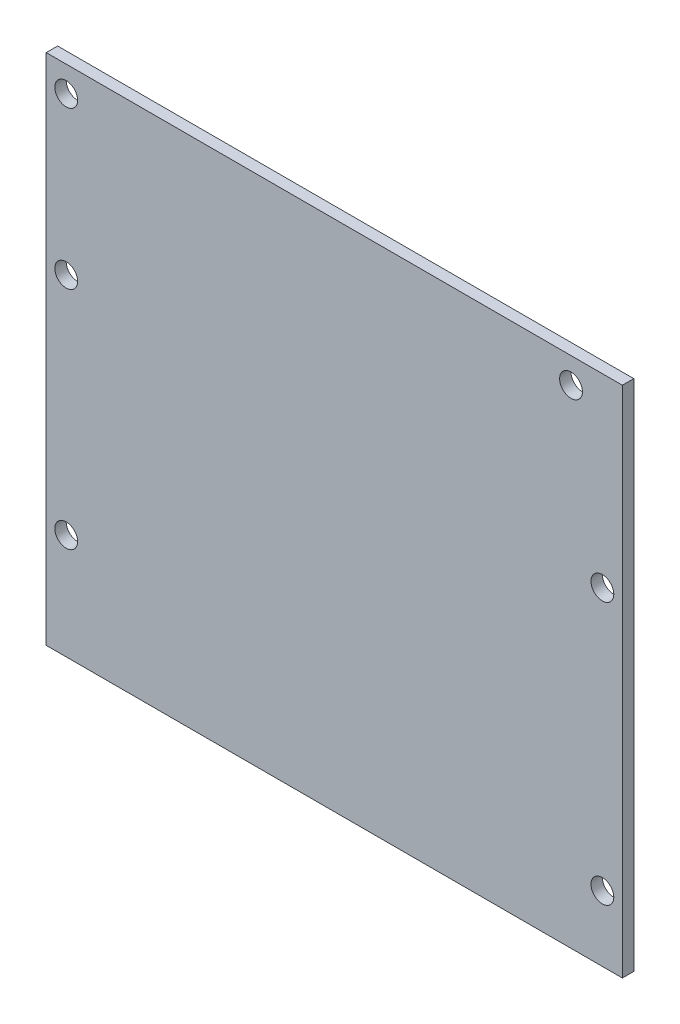
ISO-10303-21;
HEADER;
FILE_DESCRIPTION(('STEP AP214'),'2;1');
FILE_NAME('part.step','',(''),(''),'','','');
FILE_SCHEMA(('AUTOMOTIVE_DESIGN { 1 0 10303 214 1 1 1 1 }'));
ENDSEC;
DATA;
#1=APPLICATION_CONTEXT('core data for automotive mechanical design processes');
#2=APPLICATION_PROTOCOL_DEFINITION('international standard','automotive_design',2000,#1);
#3=PRODUCT_CONTEXT('',#1,'mechanical');
#4=PRODUCT('Part','Part','',(#3));
#5=PRODUCT_RELATED_PRODUCT_CATEGORY('part','',(#4));
#6=PRODUCT_DEFINITION_FORMATION('','',#4);
#7=PRODUCT_DEFINITION_CONTEXT('part definition',#1,'design');
#8=PRODUCT_DEFINITION('design','',#6,#7);
#9=PRODUCT_DEFINITION_SHAPE('','',#8);
#10=(LENGTH_UNIT() NAMED_UNIT(*) SI_UNIT(.MILLI.,.METRE.));
#11=(NAMED_UNIT(*) PLANE_ANGLE_UNIT() SI_UNIT($,.RADIAN.));
#12=(NAMED_UNIT(*) SI_UNIT($,.STERADIAN.) SOLID_ANGLE_UNIT());
#13=UNCERTAINTY_MEASURE_WITH_UNIT(LENGTH_MEASURE(1.E-05),#10,'distance_accuracy_value','');
#14=(GEOMETRIC_REPRESENTATION_CONTEXT(3) GLOBAL_UNCERTAINTY_ASSIGNED_CONTEXT((#13)) GLOBAL_UNIT_ASSIGNED_CONTEXT((#10,
#11,#12)) REPRESENTATION_CONTEXT('',''));
#15=CARTESIAN_POINT('',(0.,0.,0.));
#16=DIRECTION('',(0.,0.,1.));
#17=DIRECTION('',(1.,0.,0.));
#18=AXIS2_PLACEMENT_3D('',#15,#16,#17);
#19=CARTESIAN_POINT('',(0.,0.,2.));
#20=DIRECTION('',(1.,0.,0.));
#21=DIRECTION('',(0.,0.,-1.));
#22=AXIS2_PLACEMENT_3D('',#19,#20,#21);
#23=PLANE('',#22);
#24=DIRECTION('',(0.,-1.,0.));
#25=VECTOR('',#24,1.);
#26=CARTESIAN_POINT('',(0.,0.,0.));
#27=LINE('',#26,#25);
#28=CARTESIAN_POINT('',(0.,90.,0.));
#29=VERTEX_POINT('',#28);
#30=CARTESIAN_POINT('',(0.,0.,0.));
#31=VERTEX_POINT('',#30);
#32=EDGE_CURVE('E95',#29,#31,#27,.T.);
#33=ORIENTED_EDGE('',*,*,#32,.T.);
#34=DIRECTION('',(0.,0.,-1.));
#35=VECTOR('',#34,1.);
#36=CARTESIAN_POINT('',(0.,0.,2.));
#37=LINE('',#36,#35);
#38=CARTESIAN_POINT('',(0.,0.,2.));
#39=VERTEX_POINT('',#38);
#40=EDGE_CURVE('E11',#39,#31,#37,.T.);
#41=ORIENTED_EDGE('',*,*,#40,.F.);
#42=DIRECTION('',(0.,-1.,0.));
#43=VECTOR('',#42,1.);
#44=CARTESIAN_POINT('',(0.,0.,2.));
#45=LINE('',#44,#43);
#46=CARTESIAN_POINT('',(0.,90.,2.));
#47=VERTEX_POINT('',#46);
#48=EDGE_CURVE('E83',#47,#39,#45,.T.);
#49=ORIENTED_EDGE('',*,*,#48,.F.);
#50=DIRECTION('',(0.,0.,-1.));
#51=VECTOR('',#50,1.);
#52=CARTESIAN_POINT('',(0.,90.,2.));
#53=LINE('',#52,#51);
#54=EDGE_CURVE('E91',#47,#29,#53,.T.);
#55=ORIENTED_EDGE('',*,*,#54,.T.);
#56=EDGE_LOOP('',(#33,#41,#49,#55));
#57=FACE_BOUND('',#56,.T.);
#58=ADVANCED_FACE('F32',(#57),#23,.F.);
#59=CARTESIAN_POINT('',(0.,0.,2.));
#60=DIRECTION('',(0.,1.,0.));
#61=DIRECTION('',(0.,0.,1.));
#62=AXIS2_PLACEMENT_3D('',#59,#60,#61);
#63=PLANE('',#62);
#64=DIRECTION('',(1.,0.,0.));
#65=VECTOR('',#64,1.);
#66=CARTESIAN_POINT('',(0.,0.,0.));
#67=LINE('',#66,#65);
#68=CARTESIAN_POINT('',(101.,0.,0.));
#69=VERTEX_POINT('',#68);
#70=EDGE_CURVE('E87',#31,#69,#67,.T.);
#71=ORIENTED_EDGE('',*,*,#70,.T.);
#72=DIRECTION('',(0.,0.,-1.));
#73=VECTOR('',#72,1.);
#74=CARTESIAN_POINT('',(101.,0.,2.));
#75=LINE('',#74,#73);
#76=CARTESIAN_POINT('',(101.,0.,2.));
#77=VERTEX_POINT('',#76);
#78=EDGE_CURVE('E40',#77,#69,#75,.T.);
#79=ORIENTED_EDGE('',*,*,#78,.F.);
#80=DIRECTION('',(1.,0.,0.));
#81=VECTOR('',#80,1.);
#82=CARTESIAN_POINT('',(0.,0.,2.));
#83=LINE('',#82,#81);
#84=EDGE_CURVE('E78',#39,#77,#83,.T.);
#85=ORIENTED_EDGE('',*,*,#84,.F.);
#86=ORIENTED_EDGE('',*,*,#40,.T.);
#87=EDGE_LOOP('',(#71,#79,#85,#86));
#88=FACE_BOUND('',#87,.T.);
#89=ADVANCED_FACE('F86',(#88),#63,.F.);
#90=CARTESIAN_POINT('',(101.,0.,2.));
#91=DIRECTION('',(-1.,0.,0.));
#92=DIRECTION('',(0.,0.,1.));
#93=AXIS2_PLACEMENT_3D('',#90,#91,#92);
#94=PLANE('',#93);
#95=DIRECTION('',(0.,1.,0.));
#96=VECTOR('',#95,1.);
#97=CARTESIAN_POINT('',(101.,0.,0.));
#98=LINE('',#97,#96);
#99=CARTESIAN_POINT('',(101.,90.,0.));
#100=VERTEX_POINT('',#99);
#101=EDGE_CURVE('E65',#69,#100,#98,.T.);
#102=ORIENTED_EDGE('',*,*,#101,.T.);
#103=DIRECTION('',(0.,0.,-1.));
#104=VECTOR('',#103,1.);
#105=CARTESIAN_POINT('',(101.,90.,2.));
#106=LINE('',#105,#104);
#107=CARTESIAN_POINT('',(101.,90.,2.));
#108=VERTEX_POINT('',#107);
#109=EDGE_CURVE('E88',#108,#100,#106,.T.);
#110=ORIENTED_EDGE('',*,*,#109,.F.);
#111=DIRECTION('',(0.,1.,0.));
#112=VECTOR('',#111,1.);
#113=CARTESIAN_POINT('',(101.,0.,2.));
#114=LINE('',#113,#112);
#115=EDGE_CURVE('E81',#77,#108,#114,.T.);
#116=ORIENTED_EDGE('',*,*,#115,.F.);
#117=ORIENTED_EDGE('',*,*,#78,.T.);
#118=EDGE_LOOP('',(#102,#110,#116,#117));
#119=FACE_BOUND('',#118,.T.);
#120=ADVANCED_FACE('F89',(#119),#94,.F.);
#121=CARTESIAN_POINT('',(0.,90.,2.));
#122=DIRECTION('',(0.,-1.,0.));
#123=DIRECTION('',(0.,0.,-1.));
#124=AXIS2_PLACEMENT_3D('',#121,#122,#123);
#125=PLANE('',#124);
#126=DIRECTION('',(-1.,0.,0.));
#127=VECTOR('',#126,1.);
#128=CARTESIAN_POINT('',(0.,90.,0.));
#129=LINE('',#128,#127);
#130=EDGE_CURVE('E71',#100,#29,#129,.T.);
#131=ORIENTED_EDGE('',*,*,#130,.T.);
#132=ORIENTED_EDGE('',*,*,#54,.F.);
#133=DIRECTION('',(-1.,0.,0.));
#134=VECTOR('',#133,1.);
#135=CARTESIAN_POINT('',(0.,90.,2.));
#136=LINE('',#135,#134);
#137=EDGE_CURVE('E48',#108,#47,#136,.T.);
#138=ORIENTED_EDGE('',*,*,#137,.F.);
#139=ORIENTED_EDGE('',*,*,#109,.T.);
#140=EDGE_LOOP('',(#131,#132,#138,#139));
#141=FACE_BOUND('',#140,.T.);
#142=ADVANCED_FACE('F103',(#141),#125,.F.);
#143=CARTESIAN_POINT('',(0.,0.,2.));
#144=DIRECTION('',(0.,0.,-1.));
#145=DIRECTION('',(-1.,0.,0.));
#146=AXIS2_PLACEMENT_3D('',#143,#144,#145);
#147=PLANE('',#146);
#148=CARTESIAN_POINT('',(92.,85.5,2.));
#149=DIRECTION('',(0.,0.,1.));
#150=DIRECTION('',(1.,0.,0.));
#151=AXIS2_PLACEMENT_3D('',#148,#149,#150);
#152=CIRCLE('',#151,2.);
#153=CARTESIAN_POINT('',(94.,85.5,2.));
#154=VERTEX_POINT('',#153);
#155=EDGE_CURVE('E127',#154,#154,#152,.T.);
#156=ORIENTED_EDGE('',*,*,#155,.F.);
#157=EDGE_LOOP('',(#156));
#158=FACE_BOUND('',#157,.T.);
#159=CARTESIAN_POINT('',(3.5,85.5,2.));
#160=DIRECTION('',(0.,0.,1.));
#161=DIRECTION('',(1.,0.,0.));
#162=AXIS2_PLACEMENT_3D('',#159,#160,#161);
#163=CIRCLE('',#162,2.);
#164=CARTESIAN_POINT('',(5.5,85.5,2.));
#165=VERTEX_POINT('',#164);
#166=EDGE_CURVE('E133',#165,#165,#163,.T.);
#167=ORIENTED_EDGE('',*,*,#166,.F.);
#168=EDGE_LOOP('',(#167));
#169=FACE_BOUND('',#168,.T.);
#170=CARTESIAN_POINT('',(3.5,18.5,2.));
#171=DIRECTION('',(0.,0.,1.));
#172=DIRECTION('',(1.,0.,0.));
#173=AXIS2_PLACEMENT_3D('',#170,#171,#172);
#174=CIRCLE('',#173,2.);
#175=CARTESIAN_POINT('',(5.5,18.5,2.));
#176=VERTEX_POINT('',#175);
#177=EDGE_CURVE('E139',#176,#176,#174,.T.);
#178=ORIENTED_EDGE('',*,*,#177,.F.);
#179=EDGE_LOOP('',(#178));
#180=FACE_BOUND('',#179,.T.);
#181=CARTESIAN_POINT('',(3.5,58.,2.));
#182=DIRECTION('',(0.,0.,1.));
#183=DIRECTION('',(1.,0.,0.));
#184=AXIS2_PLACEMENT_3D('',#181,#182,#183);
#185=CIRCLE('',#184,2.);
#186=CARTESIAN_POINT('',(5.5,58.,2.));
#187=VERTEX_POINT('',#186);
#188=EDGE_CURVE('E115',#187,#187,#185,.T.);
#189=ORIENTED_EDGE('',*,*,#188,.F.);
#190=EDGE_LOOP('',(#189));
#191=FACE_BOUND('',#190,.T.);
#192=CARTESIAN_POINT('',(97.5,57.5,2.));
#193=DIRECTION('',(0.,0.,1.));
#194=DIRECTION('',(1.,0.,0.));
#195=AXIS2_PLACEMENT_3D('',#192,#193,#194);
#196=CIRCLE('',#195,2.);
#197=CARTESIAN_POINT('',(99.5,57.5,2.));
#198=VERTEX_POINT('',#197);
#199=EDGE_CURVE('E122',#198,#198,#196,.T.);
#200=ORIENTED_EDGE('',*,*,#199,.F.);
#201=EDGE_LOOP('',(#200));
#202=FACE_BOUND('',#201,.T.);
#203=CARTESIAN_POINT('',(97.5,11.5,2.));
#204=DIRECTION('',(0.,0.,1.));
#205=DIRECTION('',(1.,0.,0.));
#206=AXIS2_PLACEMENT_3D('',#203,#204,#205);
#207=CIRCLE('',#206,2.);
#208=CARTESIAN_POINT('',(99.5,11.5,2.));
#209=VERTEX_POINT('',#208);
#210=EDGE_CURVE('E109',#209,#209,#207,.T.);
#211=ORIENTED_EDGE('',*,*,#210,.F.);
#212=EDGE_LOOP('',(#211));
#213=FACE_BOUND('',#212,.T.);
#214=ORIENTED_EDGE('',*,*,#48,.T.);
#215=ORIENTED_EDGE('',*,*,#84,.T.);
#216=ORIENTED_EDGE('',*,*,#115,.T.);
#217=ORIENTED_EDGE('',*,*,#137,.T.);
#218=EDGE_LOOP('',(#214,#215,#216,#217));
#219=FACE_BOUND('',#218,.T.);
#220=ADVANCED_FACE('F79',(#158,#169,#180,#191,#202,#213,#219),#147,.F.);
#221=CARTESIAN_POINT('',(0.,0.,0.));
#222=DIRECTION('',(0.,0.,-1.));
#223=DIRECTION('',(-1.,0.,0.));
#224=AXIS2_PLACEMENT_3D('',#221,#222,#223);
#225=PLANE('',#224);
#226=CARTESIAN_POINT('',(92.,85.5,0.));
#227=DIRECTION('',(0.,0.,1.));
#228=DIRECTION('',(1.,0.,0.));
#229=AXIS2_PLACEMENT_3D('',#226,#227,#228);
#230=CIRCLE('',#229,2.);
#231=CARTESIAN_POINT('',(94.,85.5,0.));
#232=VERTEX_POINT('',#231);
#233=EDGE_CURVE('E130',#232,#232,#230,.T.);
#234=ORIENTED_EDGE('',*,*,#233,.T.);
#235=EDGE_LOOP('',(#234));
#236=FACE_BOUND('',#235,.T.);
#237=CARTESIAN_POINT('',(3.5,85.5,0.));
#238=DIRECTION('',(0.,0.,1.));
#239=DIRECTION('',(1.,0.,0.));
#240=AXIS2_PLACEMENT_3D('',#237,#238,#239);
#241=CIRCLE('',#240,2.);
#242=CARTESIAN_POINT('',(5.5,85.5,0.));
#243=VERTEX_POINT('',#242);
#244=EDGE_CURVE('E136',#243,#243,#241,.T.);
#245=ORIENTED_EDGE('',*,*,#244,.T.);
#246=EDGE_LOOP('',(#245));
#247=FACE_BOUND('',#246,.T.);
#248=CARTESIAN_POINT('',(3.5,18.5,0.));
#249=DIRECTION('',(0.,0.,1.));
#250=DIRECTION('',(1.,0.,0.));
#251=AXIS2_PLACEMENT_3D('',#248,#249,#250);
#252=CIRCLE('',#251,2.);
#253=CARTESIAN_POINT('',(5.5,18.5,0.));
#254=VERTEX_POINT('',#253);
#255=EDGE_CURVE('E119',#254,#254,#252,.T.);
#256=ORIENTED_EDGE('',*,*,#255,.T.);
#257=EDGE_LOOP('',(#256));
#258=FACE_BOUND('',#257,.T.);
#259=CARTESIAN_POINT('',(3.5,58.,0.));
#260=DIRECTION('',(0.,0.,1.));
#261=DIRECTION('',(1.,0.,0.));
#262=AXIS2_PLACEMENT_3D('',#259,#260,#261);
#263=CIRCLE('',#262,2.);
#264=CARTESIAN_POINT('',(5.5,58.,0.));
#265=VERTEX_POINT('',#264);
#266=EDGE_CURVE('E118',#265,#265,#263,.T.);
#267=ORIENTED_EDGE('',*,*,#266,.T.);
#268=EDGE_LOOP('',(#267));
#269=FACE_BOUND('',#268,.T.);
#270=CARTESIAN_POINT('',(97.5,57.5,0.));
#271=DIRECTION('',(0.,0.,1.));
#272=DIRECTION('',(1.,0.,0.));
#273=AXIS2_PLACEMENT_3D('',#270,#271,#272);
#274=CIRCLE('',#273,2.);
#275=CARTESIAN_POINT('',(99.5,57.5,0.));
#276=VERTEX_POINT('',#275);
#277=EDGE_CURVE('E112',#276,#276,#274,.T.);
#278=ORIENTED_EDGE('',*,*,#277,.T.);
#279=EDGE_LOOP('',(#278));
#280=FACE_BOUND('',#279,.T.);
#281=CARTESIAN_POINT('',(97.5,11.5,0.));
#282=DIRECTION('',(0.,0.,1.));
#283=DIRECTION('',(1.,0.,0.));
#284=AXIS2_PLACEMENT_3D('',#281,#282,#283);
#285=CIRCLE('',#284,2.);
#286=CARTESIAN_POINT('',(99.5,11.5,0.));
#287=VERTEX_POINT('',#286);
#288=EDGE_CURVE('E98',#287,#287,#285,.T.);
#289=ORIENTED_EDGE('',*,*,#288,.T.);
#290=EDGE_LOOP('',(#289));
#291=FACE_BOUND('',#290,.T.);
#292=ORIENTED_EDGE('',*,*,#32,.F.);
#293=ORIENTED_EDGE('',*,*,#130,.F.);
#294=ORIENTED_EDGE('',*,*,#101,.F.);
#295=ORIENTED_EDGE('',*,*,#70,.F.);
#296=EDGE_LOOP('',(#292,#293,#294,#295));
#297=FACE_BOUND('',#296,.T.);
#298=ADVANCED_FACE('F106',(#236,#247,#258,#269,#280,#291,#297),#225,.T.);
#299=CARTESIAN_POINT('',(97.5,11.5,0.));
#300=DIRECTION('',(0.,0.,1.));
#301=DIRECTION('',(1.,0.,0.));
#302=AXIS2_PLACEMENT_3D('',#299,#300,#301);
#303=CYLINDRICAL_SURFACE('',#302,2.);
#304=ORIENTED_EDGE('',*,*,#288,.F.);
#305=EDGE_LOOP('',(#304));
#306=FACE_BOUND('',#305,.T.);
#307=ORIENTED_EDGE('',*,*,#210,.T.);
#308=EDGE_LOOP('',(#307));
#309=FACE_BOUND('',#308,.T.);
#310=ADVANCED_FACE('F165',(#306,#309),#303,.F.);
#311=CARTESIAN_POINT('',(97.5,57.5,0.));
#312=DIRECTION('',(0.,0.,1.));
#313=DIRECTION('',(1.,0.,0.));
#314=AXIS2_PLACEMENT_3D('',#311,#312,#313);
#315=CYLINDRICAL_SURFACE('',#314,2.);
#316=ORIENTED_EDGE('',*,*,#277,.F.);
#317=EDGE_LOOP('',(#316));
#318=FACE_BOUND('',#317,.T.);
#319=ORIENTED_EDGE('',*,*,#199,.T.);
#320=EDGE_LOOP('',(#319));
#321=FACE_BOUND('',#320,.T.);
#322=ADVANCED_FACE('F167',(#318,#321),#315,.F.);
#323=CARTESIAN_POINT('',(3.5,58.,0.));
#324=DIRECTION('',(0.,0.,1.));
#325=DIRECTION('',(1.,0.,0.));
#326=AXIS2_PLACEMENT_3D('',#323,#324,#325);
#327=CYLINDRICAL_SURFACE('',#326,2.);
#328=ORIENTED_EDGE('',*,*,#266,.F.);
#329=EDGE_LOOP('',(#328));
#330=FACE_BOUND('',#329,.T.);
#331=ORIENTED_EDGE('',*,*,#188,.T.);
#332=EDGE_LOOP('',(#331));
#333=FACE_BOUND('',#332,.T.);
#334=ADVANCED_FACE('F151',(#330,#333),#327,.F.);
#335=CARTESIAN_POINT('',(3.5,18.5,0.));
#336=DIRECTION('',(0.,0.,1.));
#337=DIRECTION('',(1.,0.,0.));
#338=AXIS2_PLACEMENT_3D('',#335,#336,#337);
#339=CYLINDRICAL_SURFACE('',#338,2.);
#340=ORIENTED_EDGE('',*,*,#255,.F.);
#341=EDGE_LOOP('',(#340));
#342=FACE_BOUND('',#341,.T.);
#343=ORIENTED_EDGE('',*,*,#177,.T.);
#344=EDGE_LOOP('',(#343));
#345=FACE_BOUND('',#344,.T.);
#346=ADVANCED_FACE('F147',(#342,#345),#339,.F.);
#347=CARTESIAN_POINT('',(3.5,85.5,0.));
#348=DIRECTION('',(0.,0.,1.));
#349=DIRECTION('',(1.,0.,0.));
#350=AXIS2_PLACEMENT_3D('',#347,#348,#349);
#351=CYLINDRICAL_SURFACE('',#350,2.);
#352=ORIENTED_EDGE('',*,*,#244,.F.);
#353=EDGE_LOOP('',(#352));
#354=FACE_BOUND('',#353,.T.);
#355=ORIENTED_EDGE('',*,*,#166,.T.);
#356=EDGE_LOOP('',(#355));
#357=FACE_BOUND('',#356,.T.);
#358=ADVANCED_FACE('F150',(#354,#357),#351,.F.);
#359=CARTESIAN_POINT('',(92.,85.5,0.));
#360=DIRECTION('',(0.,0.,1.));
#361=DIRECTION('',(1.,0.,0.));
#362=AXIS2_PLACEMENT_3D('',#359,#360,#361);
#363=CYLINDRICAL_SURFACE('',#362,2.);
#364=ORIENTED_EDGE('',*,*,#233,.F.);
#365=EDGE_LOOP('',(#364));
#366=FACE_BOUND('',#365,.T.);
#367=ORIENTED_EDGE('',*,*,#155,.T.);
#368=EDGE_LOOP('',(#367));
#369=FACE_BOUND('',#368,.T.);
#370=ADVANCED_FACE('F235',(#366,#369),#363,.F.);
#371=CLOSED_SHELL('',(#58,#89,#120,#142,#220,#298,#310,#322,#334,#346,#358,#370));
#372=MANIFOLD_SOLID_BREP('B2',#371);
#373=ADVANCED_BREP_SHAPE_REPRESENTATION('',(#18,#372),#14);
#374=SHAPE_DEFINITION_REPRESENTATION(#9,#373);
ENDSEC;
END-ISO-10303-21;
